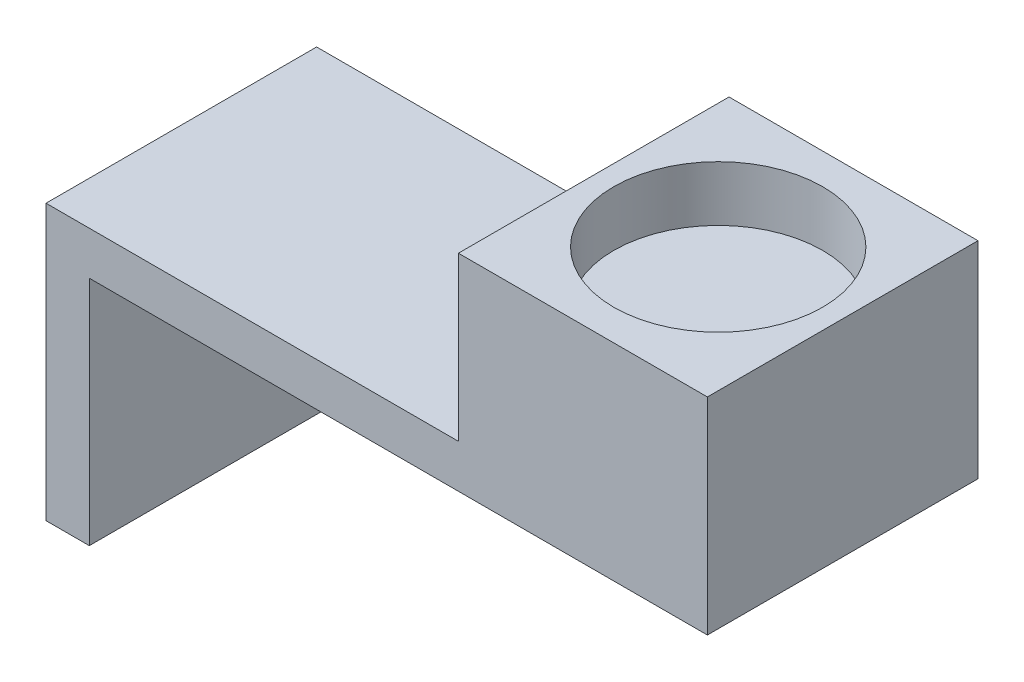
ISO-10303-21;
HEADER;
FILE_DESCRIPTION(('STEP AP214'),'2;1');
FILE_NAME('part.step','',(''),(''),'','','');
FILE_SCHEMA(('AUTOMOTIVE_DESIGN { 1 0 10303 214 1 1 1 1 }'));
ENDSEC;
DATA;
#1=APPLICATION_CONTEXT('core data for automotive mechanical design processes');
#2=APPLICATION_PROTOCOL_DEFINITION('international standard','automotive_design',2000,#1);
#3=PRODUCT_CONTEXT('',#1,'mechanical');
#4=PRODUCT('Part','Part','',(#3));
#5=PRODUCT_RELATED_PRODUCT_CATEGORY('part','',(#4));
#6=PRODUCT_DEFINITION_FORMATION('','',#4);
#7=PRODUCT_DEFINITION_CONTEXT('part definition',#1,'design');
#8=PRODUCT_DEFINITION('design','',#6,#7);
#9=PRODUCT_DEFINITION_SHAPE('','',#8);
#10=(LENGTH_UNIT() NAMED_UNIT(*) SI_UNIT(.MILLI.,.METRE.));
#11=(NAMED_UNIT(*) PLANE_ANGLE_UNIT() SI_UNIT($,.RADIAN.));
#12=(NAMED_UNIT(*) SI_UNIT($,.STERADIAN.) SOLID_ANGLE_UNIT());
#13=UNCERTAINTY_MEASURE_WITH_UNIT(LENGTH_MEASURE(1.E-05),#10,'distance_accuracy_value','');
#14=(GEOMETRIC_REPRESENTATION_CONTEXT(3) GLOBAL_UNCERTAINTY_ASSIGNED_CONTEXT((#13)) GLOBAL_UNIT_ASSIGNED_CONTEXT((#10,
#11,#12)) REPRESENTATION_CONTEXT('',''));
#15=CARTESIAN_POINT('',(0.,0.,0.));
#16=DIRECTION('',(0.,0.,1.));
#17=DIRECTION('',(1.,0.,0.));
#18=AXIS2_PLACEMENT_3D('',#15,#16,#17);
#19=CARTESIAN_POINT('',(0.,0.,0.));
#20=DIRECTION('',(0.,1.,0.));
#21=DIRECTION('',(0.,0.,1.));
#22=AXIS2_PLACEMENT_3D('',#19,#20,#21);
#23=PLANE('',#22);
#24=DIRECTION('',(0.,0.,1.));
#25=VECTOR('',#24,1.);
#26=CARTESIAN_POINT('',(-57.1,0.,0.));
#27=LINE('',#26,#25);
#28=CARTESIAN_POINT('',(-57.1,0.,-25.));
#29=VERTEX_POINT('',#28);
#30=CARTESIAN_POINT('',(-57.1,0.,0.));
#31=VERTEX_POINT('',#30);
#32=EDGE_CURVE('E11',#29,#31,#27,.T.);
#33=ORIENTED_EDGE('',*,*,#32,.F.);
#34=DIRECTION('',(-1.,0.,0.));
#35=VECTOR('',#34,1.);
#36=CARTESIAN_POINT('',(0.,0.,-25.));
#37=LINE('',#36,#35);
#38=CARTESIAN_POINT('',(0.,0.,-25.));
#39=VERTEX_POINT('',#38);
#40=EDGE_CURVE('E106',#39,#29,#37,.T.);
#41=ORIENTED_EDGE('',*,*,#40,.F.);
#42=DIRECTION('',(0.,0.,-1.));
#43=VECTOR('',#42,1.);
#44=CARTESIAN_POINT('',(0.,0.,0.));
#45=LINE('',#44,#43);
#46=CARTESIAN_POINT('',(0.,0.,0.));
#47=VERTEX_POINT('',#46);
#48=EDGE_CURVE('E149',#47,#39,#45,.T.);
#49=ORIENTED_EDGE('',*,*,#48,.F.);
#50=DIRECTION('',(1.,0.,0.));
#51=VECTOR('',#50,1.);
#52=CARTESIAN_POINT('',(0.,0.,0.));
#53=LINE('',#52,#51);
#54=EDGE_CURVE('E153',#31,#47,#53,.T.);
#55=ORIENTED_EDGE('',*,*,#54,.F.);
#56=EDGE_LOOP('',(#33,#41,#49,#55));
#57=FACE_BOUND('',#56,.T.);
#58=ADVANCED_FACE('F37',(#57),#23,.F.);
#59=CARTESIAN_POINT('',(0.,4.,0.));
#60=DIRECTION('',(-1.,0.,0.));
#61=DIRECTION('',(0.,0.,1.));
#62=AXIS2_PLACEMENT_3D('',#59,#60,#61);
#63=PLANE('',#62);
#64=ORIENTED_EDGE('',*,*,#48,.T.);
#65=DIRECTION('',(0.,-1.,0.));
#66=VECTOR('',#65,1.);
#67=CARTESIAN_POINT('',(0.,4.,-25.));
#68=LINE('',#67,#66);
#69=CARTESIAN_POINT('',(0.,19.05,-25.));
#70=VERTEX_POINT('',#69);
#71=EDGE_CURVE('E45',#70,#39,#68,.T.);
#72=ORIENTED_EDGE('',*,*,#71,.F.);
#73=DIRECTION('',(0.,0.,1.));
#74=VECTOR('',#73,1.);
#75=CARTESIAN_POINT('',(0.,19.05,0.));
#76=LINE('',#75,#74);
#77=CARTESIAN_POINT('',(0.,19.05,0.));
#78=VERTEX_POINT('',#77);
#79=EDGE_CURVE('E130',#70,#78,#76,.T.);
#80=ORIENTED_EDGE('',*,*,#79,.T.);
#81=DIRECTION('',(0.,-1.,0.));
#82=VECTOR('',#81,1.);
#83=CARTESIAN_POINT('',(0.,4.,0.));
#84=LINE('',#83,#82);
#85=EDGE_CURVE('E156',#78,#47,#84,.T.);
#86=ORIENTED_EDGE('',*,*,#85,.T.);
#87=EDGE_LOOP('',(#64,#72,#80,#86));
#88=FACE_BOUND('',#87,.T.);
#89=ADVANCED_FACE('F39',(#88),#63,.F.);
#90=CARTESIAN_POINT('',(0.,4.,-25.));
#91=DIRECTION('',(0.,0.,1.));
#92=DIRECTION('',(1.,0.,0.));
#93=AXIS2_PLACEMENT_3D('',#90,#91,#92);
#94=PLANE('',#93);
#95=DIRECTION('',(0.,-1.,0.));
#96=VECTOR('',#95,1.);
#97=CARTESIAN_POINT('',(-61.1,4.,-25.));
#98=LINE('',#97,#96);
#99=CARTESIAN_POINT('',(-61.1,4.,-25.));
#100=VERTEX_POINT('',#99);
#101=CARTESIAN_POINT('',(-61.1,-21.4,-25.));
#102=VERTEX_POINT('',#101);
#103=EDGE_CURVE('E165',#100,#102,#98,.T.);
#104=ORIENTED_EDGE('',*,*,#103,.F.);
#105=DIRECTION('',(-1.,0.,0.));
#106=VECTOR('',#105,1.);
#107=CARTESIAN_POINT('',(0.,4.,-25.));
#108=LINE('',#107,#106);
#109=CARTESIAN_POINT('',(-23.,4.,-25.));
#110=VERTEX_POINT('',#109);
#111=EDGE_CURVE('E150',#110,#100,#108,.T.);
#112=ORIENTED_EDGE('',*,*,#111,.F.);
#113=DIRECTION('',(0.,1.,0.));
#114=VECTOR('',#113,1.);
#115=CARTESIAN_POINT('',(-23.,0.,-25.));
#116=LINE('',#115,#114);
#117=CARTESIAN_POINT('',(-23.,19.05,-25.));
#118=VERTEX_POINT('',#117);
#119=EDGE_CURVE('E135',#110,#118,#116,.T.);
#120=ORIENTED_EDGE('',*,*,#119,.T.);
#121=DIRECTION('',(1.,0.,0.));
#122=VECTOR('',#121,1.);
#123=CARTESIAN_POINT('',(-23.,19.05,-25.));
#124=LINE('',#123,#122);
#125=EDGE_CURVE('E140',#118,#70,#124,.T.);
#126=ORIENTED_EDGE('',*,*,#125,.T.);
#127=ORIENTED_EDGE('',*,*,#71,.T.);
#128=ORIENTED_EDGE('',*,*,#40,.T.);
#129=DIRECTION('',(0.,-1.,0.));
#130=VECTOR('',#129,1.);
#131=CARTESIAN_POINT('',(-57.1,4.,-25.));
#132=LINE('',#131,#130);
#133=CARTESIAN_POINT('',(-57.1,-21.4,-25.));
#134=VERTEX_POINT('',#133);
#135=EDGE_CURVE('E99',#29,#134,#132,.T.);
#136=ORIENTED_EDGE('',*,*,#135,.T.);
#137=DIRECTION('',(-1.,0.,0.));
#138=VECTOR('',#137,1.);
#139=CARTESIAN_POINT('',(-57.1,-21.4,-25.));
#140=LINE('',#139,#138);
#141=EDGE_CURVE('E103',#134,#102,#140,.T.);
#142=ORIENTED_EDGE('',*,*,#141,.T.);
#143=EDGE_LOOP('',(#104,#112,#120,#126,#127,#128,#136,#142));
#144=FACE_BOUND('',#143,.T.);
#145=ADVANCED_FACE('F102',(#144),#94,.F.);
#146=CARTESIAN_POINT('',(-61.1,4.,0.));
#147=DIRECTION('',(1.,0.,0.));
#148=DIRECTION('',(0.,0.,-1.));
#149=AXIS2_PLACEMENT_3D('',#146,#147,#148);
#150=PLANE('',#149);
#151=ORIENTED_EDGE('',*,*,#103,.T.);
#152=DIRECTION('',(0.,0.,1.));
#153=VECTOR('',#152,1.);
#154=CARTESIAN_POINT('',(-61.1,-21.4,-25.));
#155=LINE('',#154,#153);
#156=CARTESIAN_POINT('',(-61.1,-21.4,0.));
#157=VERTEX_POINT('',#156);
#158=EDGE_CURVE('E111',#102,#157,#155,.T.);
#159=ORIENTED_EDGE('',*,*,#158,.T.);
#160=DIRECTION('',(0.,-1.,0.));
#161=VECTOR('',#160,1.);
#162=CARTESIAN_POINT('',(-61.1,4.,0.));
#163=LINE('',#162,#161);
#164=CARTESIAN_POINT('',(-61.1,4.,0.));
#165=VERTEX_POINT('',#164);
#166=EDGE_CURVE('E163',#165,#157,#163,.T.);
#167=ORIENTED_EDGE('',*,*,#166,.F.);
#168=DIRECTION('',(0.,0.,1.));
#169=VECTOR('',#168,1.);
#170=CARTESIAN_POINT('',(-61.1,4.,0.));
#171=LINE('',#170,#169);
#172=EDGE_CURVE('E152',#100,#165,#171,.T.);
#173=ORIENTED_EDGE('',*,*,#172,.F.);
#174=EDGE_LOOP('',(#151,#159,#167,#173));
#175=FACE_BOUND('',#174,.T.);
#176=ADVANCED_FACE('F176',(#175),#150,.F.);
#177=CARTESIAN_POINT('',(0.,4.,0.));
#178=DIRECTION('',(0.,0.,-1.));
#179=DIRECTION('',(-1.,0.,0.));
#180=AXIS2_PLACEMENT_3D('',#177,#178,#179);
#181=PLANE('',#180);
#182=ORIENTED_EDGE('',*,*,#166,.T.);
#183=DIRECTION('',(-1.,0.,0.));
#184=VECTOR('',#183,1.);
#185=CARTESIAN_POINT('',(-57.1,-21.4,0.));
#186=LINE('',#185,#184);
#187=CARTESIAN_POINT('',(-57.1,-21.4,0.));
#188=VERTEX_POINT('',#187);
#189=EDGE_CURVE('E118',#188,#157,#186,.T.);
#190=ORIENTED_EDGE('',*,*,#189,.F.);
#191=DIRECTION('',(0.,1.,0.));
#192=VECTOR('',#191,1.);
#193=CARTESIAN_POINT('',(-57.1,4.,0.));
#194=LINE('',#193,#192);
#195=EDGE_CURVE('E119',#188,#31,#194,.T.);
#196=ORIENTED_EDGE('',*,*,#195,.T.);
#197=ORIENTED_EDGE('',*,*,#54,.T.);
#198=ORIENTED_EDGE('',*,*,#85,.F.);
#199=DIRECTION('',(1.,0.,0.));
#200=VECTOR('',#199,1.);
#201=CARTESIAN_POINT('',(-23.,19.05,0.));
#202=LINE('',#201,#200);
#203=CARTESIAN_POINT('',(-23.,19.05,0.));
#204=VERTEX_POINT('',#203);
#205=EDGE_CURVE('E143',#204,#78,#202,.T.);
#206=ORIENTED_EDGE('',*,*,#205,.F.);
#207=DIRECTION('',(0.,-1.,0.));
#208=VECTOR('',#207,1.);
#209=CARTESIAN_POINT('',(-23.,0.,0.));
#210=LINE('',#209,#208);
#211=CARTESIAN_POINT('',(-23.,4.,0.));
#212=VERTEX_POINT('',#211);
#213=EDGE_CURVE('E132',#204,#212,#210,.T.);
#214=ORIENTED_EDGE('',*,*,#213,.T.);
#215=DIRECTION('',(1.,0.,0.));
#216=VECTOR('',#215,1.);
#217=CARTESIAN_POINT('',(0.,4.,0.));
#218=LINE('',#217,#216);
#219=EDGE_CURVE('E52',#165,#212,#218,.T.);
#220=ORIENTED_EDGE('',*,*,#219,.F.);
#221=EDGE_LOOP('',(#182,#190,#196,#197,#198,#206,#214,#220));
#222=FACE_BOUND('',#221,.T.);
#223=ADVANCED_FACE('F173',(#222),#181,.F.);
#224=CARTESIAN_POINT('',(0.,4.,0.));
#225=DIRECTION('',(0.,1.,0.));
#226=DIRECTION('',(0.,0.,1.));
#227=AXIS2_PLACEMENT_3D('',#224,#225,#226);
#228=PLANE('',#227);
#229=ORIENTED_EDGE('',*,*,#219,.T.);
#230=DIRECTION('',(0.,0.,1.));
#231=VECTOR('',#230,1.);
#232=CARTESIAN_POINT('',(-23.,4.,0.));
#233=LINE('',#232,#231);
#234=EDGE_CURVE('E56',#110,#212,#233,.T.);
#235=ORIENTED_EDGE('',*,*,#234,.F.);
#236=ORIENTED_EDGE('',*,*,#111,.T.);
#237=ORIENTED_EDGE('',*,*,#172,.T.);
#238=EDGE_LOOP('',(#229,#235,#236,#237));
#239=FACE_BOUND('',#238,.T.);
#240=ADVANCED_FACE('F186',(#239),#228,.T.);
#241=CARTESIAN_POINT('',(-23.,19.05,0.));
#242=DIRECTION('',(0.,1.,0.));
#243=DIRECTION('',(0.,0.,1.));
#244=AXIS2_PLACEMENT_3D('',#241,#242,#243);
#245=PLANE('',#244);
#246=CARTESIAN_POINT('',(-11.5,19.05,-12.5));
#247=DIRECTION('',(0.,1.,0.));
#248=DIRECTION('',(0.,0.,1.));
#249=AXIS2_PLACEMENT_3D('',#246,#247,#248);
#250=CIRCLE('',#249,9.65);
#251=CARTESIAN_POINT('',(-11.5,19.05,-2.85));
#252=VERTEX_POINT('',#251);
#253=EDGE_CURVE('E330',#252,#252,#250,.T.);
#254=ORIENTED_EDGE('',*,*,#253,.F.);
#255=EDGE_LOOP('',(#254));
#256=FACE_BOUND('',#255,.T.);
#257=ORIENTED_EDGE('',*,*,#79,.F.);
#258=ORIENTED_EDGE('',*,*,#125,.F.);
#259=DIRECTION('',(0.,0.,1.));
#260=VECTOR('',#259,1.);
#261=CARTESIAN_POINT('',(-23.,19.05,0.));
#262=LINE('',#261,#260);
#263=EDGE_CURVE('E137',#118,#204,#262,.T.);
#264=ORIENTED_EDGE('',*,*,#263,.T.);
#265=ORIENTED_EDGE('',*,*,#205,.T.);
#266=EDGE_LOOP('',(#257,#258,#264,#265));
#267=FACE_BOUND('',#266,.T.);
#268=ADVANCED_FACE('F184',(#256,#267),#245,.T.);
#269=CARTESIAN_POINT('',(-23.,0.,0.));
#270=DIRECTION('',(-1.,0.,0.));
#271=DIRECTION('',(0.,0.,1.));
#272=AXIS2_PLACEMENT_3D('',#269,#270,#271);
#273=PLANE('',#272);
#274=ORIENTED_EDGE('',*,*,#119,.F.);
#275=ORIENTED_EDGE('',*,*,#234,.T.);
#276=ORIENTED_EDGE('',*,*,#213,.F.);
#277=ORIENTED_EDGE('',*,*,#263,.F.);
#278=EDGE_LOOP('',(#274,#275,#276,#277));
#279=FACE_BOUND('',#278,.T.);
#280=ADVANCED_FACE('F181',(#279),#273,.T.);
#281=CARTESIAN_POINT('',(-57.1,0.,0.));
#282=DIRECTION('',(-1.,0.,0.));
#283=DIRECTION('',(0.,0.,1.));
#284=AXIS2_PLACEMENT_3D('',#281,#282,#283);
#285=PLANE('',#284);
#286=ORIENTED_EDGE('',*,*,#135,.F.);
#287=ORIENTED_EDGE('',*,*,#32,.T.);
#288=ORIENTED_EDGE('',*,*,#195,.F.);
#289=DIRECTION('',(0.,0.,1.));
#290=VECTOR('',#289,1.);
#291=CARTESIAN_POINT('',(-57.1,-21.4,-25.));
#292=LINE('',#291,#290);
#293=EDGE_CURVE('E110',#134,#188,#292,.T.);
#294=ORIENTED_EDGE('',*,*,#293,.F.);
#295=EDGE_LOOP('',(#286,#287,#288,#294));
#296=FACE_BOUND('',#295,.T.);
#297=ADVANCED_FACE('F122',(#296),#285,.F.);
#298=CARTESIAN_POINT('',(-57.1,-21.4,-25.));
#299=DIRECTION('',(0.,-1.,0.));
#300=DIRECTION('',(0.,0.,-1.));
#301=AXIS2_PLACEMENT_3D('',#298,#299,#300);
#302=PLANE('',#301);
#303=ORIENTED_EDGE('',*,*,#158,.F.);
#304=ORIENTED_EDGE('',*,*,#141,.F.);
#305=ORIENTED_EDGE('',*,*,#293,.T.);
#306=ORIENTED_EDGE('',*,*,#189,.T.);
#307=EDGE_LOOP('',(#303,#304,#305,#306));
#308=FACE_BOUND('',#307,.T.);
#309=ADVANCED_FACE('F115',(#308),#302,.T.);
#310=CARTESIAN_POINT('',(-11.5,13.95,-12.5));
#311=DIRECTION('',(0.,1.,0.));
#312=DIRECTION('',(0.,0.,1.));
#313=AXIS2_PLACEMENT_3D('',#310,#311,#312);
#314=CYLINDRICAL_SURFACE('',#313,9.65);
#315=CARTESIAN_POINT('',(-11.5,13.95,-12.5));
#316=DIRECTION('',(0.,1.,0.));
#317=DIRECTION('',(0.,0.,1.));
#318=AXIS2_PLACEMENT_3D('',#315,#316,#317);
#319=CIRCLE('',#318,9.65);
#320=CARTESIAN_POINT('',(-11.5,13.95,-2.85));
#321=VERTEX_POINT('',#320);
#322=EDGE_CURVE('E129',#321,#321,#319,.T.);
#323=ORIENTED_EDGE('',*,*,#322,.F.);
#324=EDGE_LOOP('',(#323));
#325=FACE_BOUND('',#324,.T.);
#326=ORIENTED_EDGE('',*,*,#253,.T.);
#327=EDGE_LOOP('',(#326));
#328=FACE_BOUND('',#327,.T.);
#329=ADVANCED_FACE('F242',(#325,#328),#314,.F.);
#330=CARTESIAN_POINT('',(-11.5,13.95,-12.5));
#331=DIRECTION('',(0.,1.,0.));
#332=DIRECTION('',(0.,0.,1.));
#333=AXIS2_PLACEMENT_3D('',#330,#331,#332);
#334=PLANE('',#333);
#335=ORIENTED_EDGE('',*,*,#322,.T.);
#336=EDGE_LOOP('',(#335));
#337=FACE_BOUND('',#336,.T.);
#338=ADVANCED_FACE('F260',(#337),#334,.T.);
#339=CLOSED_SHELL('',(#58,#89,#145,#176,#223,#240,#268,#280,#297,#309,#329,#338));
#340=MANIFOLD_SOLID_BREP('B2',#339);
#341=ADVANCED_BREP_SHAPE_REPRESENTATION('',(#18,#340),#14);
#342=SHAPE_DEFINITION_REPRESENTATION(#9,#341);
ENDSEC;
END-ISO-10303-21;
